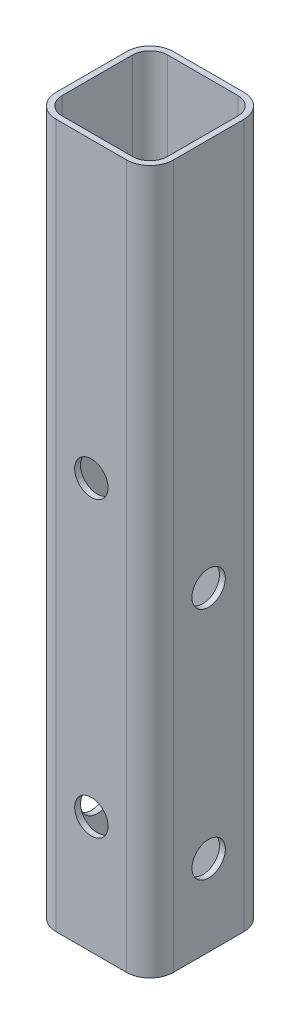
ISO-10303-21;
HEADER;
FILE_DESCRIPTION(('STEP AP214'),'2;1');
FILE_NAME('part.step','',(''),(''),'','','');
FILE_SCHEMA(('AUTOMOTIVE_DESIGN { 1 0 10303 214 1 1 1 1 }'));
ENDSEC;
DATA;
#1=APPLICATION_CONTEXT('core data for automotive mechanical design processes');
#2=APPLICATION_PROTOCOL_DEFINITION('international standard','automotive_design',2000,#1);
#3=PRODUCT_CONTEXT('',#1,'mechanical');
#4=PRODUCT('Part','Part','',(#3));
#5=PRODUCT_RELATED_PRODUCT_CATEGORY('part','',(#4));
#6=PRODUCT_DEFINITION_FORMATION('','',#4);
#7=PRODUCT_DEFINITION_CONTEXT('part definition',#1,'design');
#8=PRODUCT_DEFINITION('design','',#6,#7);
#9=PRODUCT_DEFINITION_SHAPE('','',#8);
#10=(LENGTH_UNIT() NAMED_UNIT(*) SI_UNIT(.MILLI.,.METRE.));
#11=(NAMED_UNIT(*) PLANE_ANGLE_UNIT() SI_UNIT($,.RADIAN.));
#12=(NAMED_UNIT(*) SI_UNIT($,.STERADIAN.) SOLID_ANGLE_UNIT());
#13=UNCERTAINTY_MEASURE_WITH_UNIT(LENGTH_MEASURE(1.E-05),#10,'distance_accuracy_value','');
#14=(GEOMETRIC_REPRESENTATION_CONTEXT(3) GLOBAL_UNCERTAINTY_ASSIGNED_CONTEXT((#13)) GLOBAL_UNIT_ASSIGNED_CONTEXT((#10,
#11,#12)) REPRESENTATION_CONTEXT('',''));
#15=CARTESIAN_POINT('',(0.,0.,0.));
#16=DIRECTION('',(0.,0.,1.));
#17=DIRECTION('',(1.,0.,0.));
#18=AXIS2_PLACEMENT_3D('',#15,#16,#17);
#19=CARTESIAN_POINT('',(-7.62000000000001,152.4,7.62000000000001));
#20=DIRECTION('',(0.,1.,0.));
#21=DIRECTION('',(0.,0.,1.));
#22=AXIS2_PLACEMENT_3D('',#19,#20,#21);
#23=PLANE('',#22);
#24=CARTESIAN_POINT('',(-7.62000000000001,152.4,7.62000000000001));
#25=DIRECTION('',(0.,1.,0.));
#26=DIRECTION('',(0.,0.,1.));
#27=AXIS2_PLACEMENT_3D('',#24,#25,#26);
#28=CIRCLE('',#27,5.08);
#29=CARTESIAN_POINT('',(-12.7,152.4,7.62000000000001));
#30=VERTEX_POINT('',#29);
#31=CARTESIAN_POINT('',(-7.62000000000001,152.4,12.7));
#32=VERTEX_POINT('',#31);
#33=EDGE_CURVE('E220',#30,#32,#28,.T.);
#34=ORIENTED_EDGE('',*,*,#33,.T.);
#35=DIRECTION('',(1.,0.,0.));
#36=VECTOR('',#35,1.);
#37=CARTESIAN_POINT('',(-7.62000000000001,152.4,12.7));
#38=LINE('',#37,#36);
#39=CARTESIAN_POINT('',(7.62,152.4,12.7));
#40=VERTEX_POINT('',#39);
#41=EDGE_CURVE('E223',#32,#40,#38,.T.);
#42=ORIENTED_EDGE('',*,*,#41,.T.);
#43=CARTESIAN_POINT('',(7.62,152.4,7.62000000000001));
#44=DIRECTION('',(0.,1.,0.));
#45=DIRECTION('',(0.,0.,-1.));
#46=AXIS2_PLACEMENT_3D('',#43,#44,#45);
#47=CIRCLE('',#46,5.08);
#48=CARTESIAN_POINT('',(12.7,152.4,7.62000000000001));
#49=VERTEX_POINT('',#48);
#50=EDGE_CURVE('E226',#40,#49,#47,.T.);
#51=ORIENTED_EDGE('',*,*,#50,.T.);
#52=DIRECTION('',(0.,0.,-1.));
#53=VECTOR('',#52,1.);
#54=CARTESIAN_POINT('',(12.7,152.4,-7.62000000000001));
#55=LINE('',#54,#53);
#56=CARTESIAN_POINT('',(12.7,152.4,-7.62000000000001));
#57=VERTEX_POINT('',#56);
#58=EDGE_CURVE('E228',#49,#57,#55,.T.);
#59=ORIENTED_EDGE('',*,*,#58,.T.);
#60=CARTESIAN_POINT('',(7.62,152.4,-7.62000000000001));
#61=DIRECTION('',(0.,1.,0.));
#62=DIRECTION('',(0.,0.,-1.));
#63=AXIS2_PLACEMENT_3D('',#60,#61,#62);
#64=CIRCLE('',#63,5.08);
#65=CARTESIAN_POINT('',(7.62000000000001,152.4,-12.7));
#66=VERTEX_POINT('',#65);
#67=EDGE_CURVE('E230',#57,#66,#64,.T.);
#68=ORIENTED_EDGE('',*,*,#67,.T.);
#69=DIRECTION('',(-1.,0.,0.));
#70=VECTOR('',#69,1.);
#71=CARTESIAN_POINT('',(-7.62000000000001,152.4,-12.7));
#72=LINE('',#71,#70);
#73=CARTESIAN_POINT('',(-7.62,152.4,-12.7));
#74=VERTEX_POINT('',#73);
#75=EDGE_CURVE('E232',#66,#74,#72,.T.);
#76=ORIENTED_EDGE('',*,*,#75,.T.);
#77=CARTESIAN_POINT('',(-7.62,152.4,-7.62000000000001));
#78=DIRECTION('',(0.,1.,0.));
#79=DIRECTION('',(0.,0.,-1.));
#80=AXIS2_PLACEMENT_3D('',#77,#78,#79);
#81=CIRCLE('',#80,5.08);
#82=CARTESIAN_POINT('',(-12.7,152.4,-7.62000000000001));
#83=VERTEX_POINT('',#82);
#84=EDGE_CURVE('E234',#74,#83,#81,.T.);
#85=ORIENTED_EDGE('',*,*,#84,.T.);
#86=DIRECTION('',(0.,0.,1.));
#87=VECTOR('',#86,1.);
#88=CARTESIAN_POINT('',(-12.7,152.4,-7.62000000000001));
#89=LINE('',#88,#87);
#90=EDGE_CURVE('E236',#83,#30,#89,.T.);
#91=ORIENTED_EDGE('',*,*,#90,.T.);
#92=EDGE_LOOP('',(#34,#42,#51,#59,#68,#76,#85,#91));
#93=FACE_BOUND('',#92,.T.);
#94=DIRECTION('',(0.,0.,1.));
#95=VECTOR('',#94,1.);
#96=CARTESIAN_POINT('',(-11.43,152.4,-7.62000000000001));
#97=LINE('',#96,#95);
#98=CARTESIAN_POINT('',(-11.43,152.4,-7.62000000000001));
#99=VERTEX_POINT('',#98);
#100=CARTESIAN_POINT('',(-11.43,152.4,7.62000000000001));
#101=VERTEX_POINT('',#100);
#102=EDGE_CURVE('E161',#99,#101,#97,.T.);
#103=ORIENTED_EDGE('',*,*,#102,.F.);
#104=CARTESIAN_POINT('',(-7.62,152.4,-7.62000000000001));
#105=DIRECTION('',(0.,1.,0.));
#106=DIRECTION('',(0.,0.,-1.));
#107=AXIS2_PLACEMENT_3D('',#104,#105,#106);
#108=CIRCLE('',#107,3.81);
#109=CARTESIAN_POINT('',(-7.62000000000001,152.4,-11.43));
#110=VERTEX_POINT('',#109);
#111=EDGE_CURVE('E153',#110,#99,#108,.T.);
#112=ORIENTED_EDGE('',*,*,#111,.F.);
#113=DIRECTION('',(-1.,0.,0.));
#114=VECTOR('',#113,1.);
#115=CARTESIAN_POINT('',(-7.62000000000001,152.4,-11.43));
#116=LINE('',#115,#114);
#117=CARTESIAN_POINT('',(7.62,152.4,-11.43));
#118=VERTEX_POINT('',#117);
#119=EDGE_CURVE('E187',#118,#110,#116,.T.);
#120=ORIENTED_EDGE('',*,*,#119,.F.);
#121=CARTESIAN_POINT('',(7.62,152.4,-7.62000000000001));
#122=DIRECTION('',(0.,1.,0.));
#123=DIRECTION('',(0.,0.,-1.));
#124=AXIS2_PLACEMENT_3D('',#121,#122,#123);
#125=CIRCLE('',#124,3.81);
#126=CARTESIAN_POINT('',(11.43,152.4,-7.62000000000001));
#127=VERTEX_POINT('',#126);
#128=EDGE_CURVE('E185',#127,#118,#125,.T.);
#129=ORIENTED_EDGE('',*,*,#128,.F.);
#130=DIRECTION('',(0.,0.,-1.));
#131=VECTOR('',#130,1.);
#132=CARTESIAN_POINT('',(11.43,152.4,-7.62000000000001));
#133=LINE('',#132,#131);
#134=CARTESIAN_POINT('',(11.43,152.4,7.62000000000001));
#135=VERTEX_POINT('',#134);
#136=EDGE_CURVE('E183',#135,#127,#133,.T.);
#137=ORIENTED_EDGE('',*,*,#136,.F.);
#138=CARTESIAN_POINT('',(7.62,152.4,7.62000000000001));
#139=DIRECTION('',(0.,1.,0.));
#140=DIRECTION('',(0.,0.,-1.));
#141=AXIS2_PLACEMENT_3D('',#138,#139,#140);
#142=CIRCLE('',#141,3.81);
#143=CARTESIAN_POINT('',(7.62,152.4,11.43));
#144=VERTEX_POINT('',#143);
#145=EDGE_CURVE('E181',#144,#135,#142,.T.);
#146=ORIENTED_EDGE('',*,*,#145,.F.);
#147=DIRECTION('',(1.,0.,0.));
#148=VECTOR('',#147,1.);
#149=CARTESIAN_POINT('',(-7.62000000000001,152.4,11.43));
#150=LINE('',#149,#148);
#151=CARTESIAN_POINT('',(-7.62000000000001,152.4,11.43));
#152=VERTEX_POINT('',#151);
#153=EDGE_CURVE('E176',#152,#144,#150,.T.);
#154=ORIENTED_EDGE('',*,*,#153,.F.);
#155=CARTESIAN_POINT('',(-7.62000000000001,152.4,7.62000000000001));
#156=DIRECTION('',(0.,1.,0.));
#157=DIRECTION('',(0.,0.,1.));
#158=AXIS2_PLACEMENT_3D('',#155,#156,#157);
#159=CIRCLE('',#158,3.81);
#160=EDGE_CURVE('E174',#101,#152,#159,.T.);
#161=ORIENTED_EDGE('',*,*,#160,.F.);
#162=EDGE_LOOP('',(#103,#112,#120,#129,#137,#146,#154,#161));
#163=FACE_BOUND('',#162,.T.);
#164=ADVANCED_FACE('F38',(#93,#163),#23,.T.);
#165=CARTESIAN_POINT('',(-7.62000000000001,0.,7.62000000000001));
#166=DIRECTION('',(0.,1.,0.));
#167=DIRECTION('',(0.,0.,1.));
#168=AXIS2_PLACEMENT_3D('',#165,#166,#167);
#169=PLANE('',#168);
#170=CARTESIAN_POINT('',(-7.62000000000001,0.,7.62000000000001));
#171=DIRECTION('',(0.,1.,0.));
#172=DIRECTION('',(0.,0.,1.));
#173=AXIS2_PLACEMENT_3D('',#170,#171,#172);
#174=CIRCLE('',#173,5.08);
#175=CARTESIAN_POINT('',(-12.7,0.,7.62000000000001));
#176=VERTEX_POINT('',#175);
#177=CARTESIAN_POINT('',(-7.62000000000001,0.,12.7));
#178=VERTEX_POINT('',#177);
#179=EDGE_CURVE('E169',#176,#178,#174,.T.);
#180=ORIENTED_EDGE('',*,*,#179,.F.);
#181=DIRECTION('',(0.,0.,1.));
#182=VECTOR('',#181,1.);
#183=CARTESIAN_POINT('',(-12.7,0.,-7.62000000000001));
#184=LINE('',#183,#182);
#185=CARTESIAN_POINT('',(-12.7,0.,-7.62000000000001));
#186=VERTEX_POINT('',#185);
#187=EDGE_CURVE('E224',#186,#176,#184,.T.);
#188=ORIENTED_EDGE('',*,*,#187,.F.);
#189=CARTESIAN_POINT('',(-7.62,0.,-7.62000000000001));
#190=DIRECTION('',(0.,1.,0.));
#191=DIRECTION('',(0.,0.,-1.));
#192=AXIS2_PLACEMENT_3D('',#189,#190,#191);
#193=CIRCLE('',#192,5.08);
#194=CARTESIAN_POINT('',(-7.62,0.,-12.7));
#195=VERTEX_POINT('',#194);
#196=EDGE_CURVE('E251',#195,#186,#193,.T.);
#197=ORIENTED_EDGE('',*,*,#196,.F.);
#198=DIRECTION('',(-1.,0.,0.));
#199=VECTOR('',#198,1.);
#200=CARTESIAN_POINT('',(-7.62000000000001,0.,-12.7));
#201=LINE('',#200,#199);
#202=CARTESIAN_POINT('',(7.62000000000001,0.,-12.7));
#203=VERTEX_POINT('',#202);
#204=EDGE_CURVE('E249',#203,#195,#201,.T.);
#205=ORIENTED_EDGE('',*,*,#204,.F.);
#206=CARTESIAN_POINT('',(7.62,0.,-7.62000000000001));
#207=DIRECTION('',(0.,1.,0.));
#208=DIRECTION('',(0.,0.,-1.));
#209=AXIS2_PLACEMENT_3D('',#206,#207,#208);
#210=CIRCLE('',#209,5.08);
#211=CARTESIAN_POINT('',(12.7,0.,-7.62000000000001));
#212=VERTEX_POINT('',#211);
#213=EDGE_CURVE('E247',#212,#203,#210,.T.);
#214=ORIENTED_EDGE('',*,*,#213,.F.);
#215=DIRECTION('',(0.,0.,-1.));
#216=VECTOR('',#215,1.);
#217=CARTESIAN_POINT('',(12.7,0.,-7.62000000000001));
#218=LINE('',#217,#216);
#219=CARTESIAN_POINT('',(12.7,0.,7.62000000000001));
#220=VERTEX_POINT('',#219);
#221=EDGE_CURVE('E245',#220,#212,#218,.T.);
#222=ORIENTED_EDGE('',*,*,#221,.F.);
#223=CARTESIAN_POINT('',(7.62,0.,7.62000000000001));
#224=DIRECTION('',(0.,1.,0.));
#225=DIRECTION('',(0.,0.,-1.));
#226=AXIS2_PLACEMENT_3D('',#223,#224,#225);
#227=CIRCLE('',#226,5.08);
#228=CARTESIAN_POINT('',(7.62,0.,12.7));
#229=VERTEX_POINT('',#228);
#230=EDGE_CURVE('E243',#229,#220,#227,.T.);
#231=ORIENTED_EDGE('',*,*,#230,.F.);
#232=DIRECTION('',(1.,0.,0.));
#233=VECTOR('',#232,1.);
#234=CARTESIAN_POINT('',(-7.62000000000001,0.,12.7));
#235=LINE('',#234,#233);
#236=EDGE_CURVE('E241',#178,#229,#235,.T.);
#237=ORIENTED_EDGE('',*,*,#236,.F.);
#238=EDGE_LOOP('',(#180,#188,#197,#205,#214,#222,#231,#237));
#239=FACE_BOUND('',#238,.T.);
#240=CARTESIAN_POINT('',(-7.62,0.,-7.62000000000001));
#241=DIRECTION('',(0.,1.,0.));
#242=DIRECTION('',(0.,0.,-1.));
#243=AXIS2_PLACEMENT_3D('',#240,#241,#242);
#244=CIRCLE('',#243,3.81);
#245=CARTESIAN_POINT('',(-7.62000000000001,0.,-11.43));
#246=VERTEX_POINT('',#245);
#247=CARTESIAN_POINT('',(-11.43,0.,-7.62000000000001));
#248=VERTEX_POINT('',#247);
#249=EDGE_CURVE('E63',#246,#248,#244,.T.);
#250=ORIENTED_EDGE('',*,*,#249,.T.);
#251=DIRECTION('',(0.,0.,1.));
#252=VECTOR('',#251,1.);
#253=CARTESIAN_POINT('',(-11.43,0.,-7.62000000000001));
#254=LINE('',#253,#252);
#255=CARTESIAN_POINT('',(-11.43,0.,7.62000000000001));
#256=VERTEX_POINT('',#255);
#257=EDGE_CURVE('E168',#248,#256,#254,.T.);
#258=ORIENTED_EDGE('',*,*,#257,.T.);
#259=CARTESIAN_POINT('',(-7.62000000000001,0.,7.62000000000001));
#260=DIRECTION('',(0.,1.,0.));
#261=DIRECTION('',(0.,0.,1.));
#262=AXIS2_PLACEMENT_3D('',#259,#260,#261);
#263=CIRCLE('',#262,3.81);
#264=CARTESIAN_POINT('',(-7.62000000000001,0.,11.43));
#265=VERTEX_POINT('',#264);
#266=EDGE_CURVE('E192',#256,#265,#263,.T.);
#267=ORIENTED_EDGE('',*,*,#266,.T.);
#268=DIRECTION('',(1.,0.,0.));
#269=VECTOR('',#268,1.);
#270=CARTESIAN_POINT('',(-7.62000000000001,0.,11.43));
#271=LINE('',#270,#269);
#272=CARTESIAN_POINT('',(7.62,0.,11.43));
#273=VERTEX_POINT('',#272);
#274=EDGE_CURVE('E195',#265,#273,#271,.T.);
#275=ORIENTED_EDGE('',*,*,#274,.T.);
#276=CARTESIAN_POINT('',(7.62,0.,7.62000000000001));
#277=DIRECTION('',(0.,1.,0.));
#278=DIRECTION('',(0.,0.,-1.));
#279=AXIS2_PLACEMENT_3D('',#276,#277,#278);
#280=CIRCLE('',#279,3.81);
#281=CARTESIAN_POINT('',(11.43,0.,7.62000000000001));
#282=VERTEX_POINT('',#281);
#283=EDGE_CURVE('E198',#273,#282,#280,.T.);
#284=ORIENTED_EDGE('',*,*,#283,.T.);
#285=DIRECTION('',(0.,0.,-1.));
#286=VECTOR('',#285,1.);
#287=CARTESIAN_POINT('',(11.43,0.,-7.62000000000001));
#288=LINE('',#287,#286);
#289=CARTESIAN_POINT('',(11.43,0.,-7.62000000000001));
#290=VERTEX_POINT('',#289);
#291=EDGE_CURVE('E201',#282,#290,#288,.T.);
#292=ORIENTED_EDGE('',*,*,#291,.T.);
#293=CARTESIAN_POINT('',(7.62,0.,-7.62000000000001));
#294=DIRECTION('',(0.,1.,0.));
#295=DIRECTION('',(0.,0.,-1.));
#296=AXIS2_PLACEMENT_3D('',#293,#294,#295);
#297=CIRCLE('',#296,3.81);
#298=CARTESIAN_POINT('',(7.62000000000001,0.,-11.43));
#299=VERTEX_POINT('',#298);
#300=EDGE_CURVE('E204',#290,#299,#297,.T.);
#301=ORIENTED_EDGE('',*,*,#300,.T.);
#302=DIRECTION('',(-1.,0.,0.));
#303=VECTOR('',#302,1.);
#304=CARTESIAN_POINT('',(-7.62000000000001,0.,-11.43));
#305=LINE('',#304,#303);
#306=EDGE_CURVE('E162',#299,#246,#305,.T.);
#307=ORIENTED_EDGE('',*,*,#306,.T.);
#308=EDGE_LOOP('',(#250,#258,#267,#275,#284,#292,#301,#307));
#309=FACE_BOUND('',#308,.T.);
#310=ADVANCED_FACE('F337',(#239,#309),#169,.F.);
#311=CARTESIAN_POINT('',(-7.62000000000001,152.4,7.62000000000001));
#312=DIRECTION('',(0.,-1.,0.));
#313=DIRECTION('',(0.,0.,-1.));
#314=AXIS2_PLACEMENT_3D('',#311,#312,#313);
#315=CYLINDRICAL_SURFACE('',#314,5.08);
#316=ORIENTED_EDGE('',*,*,#179,.T.);
#317=DIRECTION('',(0.,-1.,0.));
#318=VECTOR('',#317,1.);
#319=CARTESIAN_POINT('',(-7.62000000000001,152.4,12.7));
#320=LINE('',#319,#318);
#321=EDGE_CURVE('E11',#32,#178,#320,.T.);
#322=ORIENTED_EDGE('',*,*,#321,.F.);
#323=ORIENTED_EDGE('',*,*,#33,.F.);
#324=DIRECTION('',(0.,-1.,0.));
#325=VECTOR('',#324,1.);
#326=CARTESIAN_POINT('',(-12.7,152.4,7.62000000000001));
#327=LINE('',#326,#325);
#328=EDGE_CURVE('E238',#30,#176,#327,.T.);
#329=ORIENTED_EDGE('',*,*,#328,.T.);
#330=EDGE_LOOP('',(#316,#322,#323,#329));
#331=FACE_BOUND('',#330,.T.);
#332=ADVANCED_FACE('F40',(#331),#315,.T.);
#333=CARTESIAN_POINT('',(-7.62000000000001,152.4,12.7));
#334=DIRECTION('',(0.,0.,-1.));
#335=DIRECTION('',(-1.,0.,0.));
#336=AXIS2_PLACEMENT_3D('',#333,#334,#335);
#337=PLANE('',#336);
#338=CARTESIAN_POINT('',(0.,88.9,12.7));
#339=DIRECTION('',(0.,0.,1.));
#340=DIRECTION('',(1.,0.,0.));
#341=AXIS2_PLACEMENT_3D('',#338,#339,#340);
#342=CIRCLE('',#341,3.6195);
#343=CARTESIAN_POINT('',(3.6195,88.9,12.7));
#344=VERTEX_POINT('',#343);
#345=EDGE_CURVE('E308',#344,#344,#342,.T.);
#346=ORIENTED_EDGE('',*,*,#345,.F.);
#347=EDGE_LOOP('',(#346));
#348=FACE_BOUND('',#347,.T.);
#349=CARTESIAN_POINT('',(0.,25.4,12.7));
#350=DIRECTION('',(0.,0.,1.));
#351=DIRECTION('',(1.,0.,0.));
#352=AXIS2_PLACEMENT_3D('',#349,#350,#351);
#353=CIRCLE('',#352,3.6195);
#354=CARTESIAN_POINT('',(3.6195,25.4,12.7));
#355=VERTEX_POINT('',#354);
#356=EDGE_CURVE('E311',#355,#355,#353,.T.);
#357=ORIENTED_EDGE('',*,*,#356,.F.);
#358=EDGE_LOOP('',(#357));
#359=FACE_BOUND('',#358,.T.);
#360=ORIENTED_EDGE('',*,*,#236,.T.);
#361=DIRECTION('',(0.,-1.,0.));
#362=VECTOR('',#361,1.);
#363=CARTESIAN_POINT('',(7.62,152.4,12.7));
#364=LINE('',#363,#362);
#365=EDGE_CURVE('E47',#40,#229,#364,.T.);
#366=ORIENTED_EDGE('',*,*,#365,.F.);
#367=ORIENTED_EDGE('',*,*,#41,.F.);
#368=ORIENTED_EDGE('',*,*,#321,.T.);
#369=EDGE_LOOP('',(#360,#366,#367,#368));
#370=FACE_BOUND('',#369,.T.);
#371=ADVANCED_FACE('F379',(#348,#359,#370),#337,.F.);
#372=CARTESIAN_POINT('',(7.62,152.4,7.62000000000001));
#373=DIRECTION('',(0.,-1.,0.));
#374=DIRECTION('',(0.,0.,-1.));
#375=AXIS2_PLACEMENT_3D('',#372,#373,#374);
#376=CYLINDRICAL_SURFACE('',#375,5.08);
#377=ORIENTED_EDGE('',*,*,#230,.T.);
#378=DIRECTION('',(0.,-1.,0.));
#379=VECTOR('',#378,1.);
#380=CARTESIAN_POINT('',(12.7,152.4,7.62000000000001));
#381=LINE('',#380,#379);
#382=EDGE_CURVE('E268',#49,#220,#381,.T.);
#383=ORIENTED_EDGE('',*,*,#382,.F.);
#384=ORIENTED_EDGE('',*,*,#50,.F.);
#385=ORIENTED_EDGE('',*,*,#365,.T.);
#386=EDGE_LOOP('',(#377,#383,#384,#385));
#387=FACE_BOUND('',#386,.T.);
#388=ADVANCED_FACE('F377',(#387),#376,.T.);
#389=CARTESIAN_POINT('',(12.7,152.4,-7.62000000000001));
#390=DIRECTION('',(-1.,0.,0.));
#391=DIRECTION('',(0.,0.,1.));
#392=AXIS2_PLACEMENT_3D('',#389,#390,#391);
#393=PLANE('',#392);
#394=CARTESIAN_POINT('',(12.7,17.526,0.));
#395=DIRECTION('',(-1.,0.,0.));
#396=DIRECTION('',(0.,0.,1.));
#397=AXIS2_PLACEMENT_3D('',#394,#395,#396);
#398=CIRCLE('',#397,3.6195);
#399=CARTESIAN_POINT('',(12.7,17.526,3.6195));
#400=VERTEX_POINT('',#399);
#401=EDGE_CURVE('E283',#400,#400,#398,.T.);
#402=ORIENTED_EDGE('',*,*,#401,.T.);
#403=EDGE_LOOP('',(#402));
#404=FACE_BOUND('',#403,.T.);
#405=CARTESIAN_POINT('',(12.7,68.326,0.));
#406=DIRECTION('',(-1.,0.,0.));
#407=DIRECTION('',(0.,0.,1.));
#408=AXIS2_PLACEMENT_3D('',#405,#406,#407);
#409=CIRCLE('',#408,3.6195);
#410=CARTESIAN_POINT('',(12.7,68.326,3.6195));
#411=VERTEX_POINT('',#410);
#412=EDGE_CURVE('E299',#411,#411,#409,.T.);
#413=ORIENTED_EDGE('',*,*,#412,.T.);
#414=EDGE_LOOP('',(#413));
#415=FACE_BOUND('',#414,.T.);
#416=ORIENTED_EDGE('',*,*,#221,.T.);
#417=DIRECTION('',(0.,-1.,0.));
#418=VECTOR('',#417,1.);
#419=CARTESIAN_POINT('',(12.7,152.4,-7.62000000000001));
#420=LINE('',#419,#418);
#421=EDGE_CURVE('E265',#57,#212,#420,.T.);
#422=ORIENTED_EDGE('',*,*,#421,.F.);
#423=ORIENTED_EDGE('',*,*,#58,.F.);
#424=ORIENTED_EDGE('',*,*,#382,.T.);
#425=EDGE_LOOP('',(#416,#422,#423,#424));
#426=FACE_BOUND('',#425,.T.);
#427=ADVANCED_FACE('F373',(#404,#415,#426),#393,.F.);
#428=CARTESIAN_POINT('',(7.62,152.4,-7.62000000000001));
#429=DIRECTION('',(0.,-1.,0.));
#430=DIRECTION('',(0.,0.,-1.));
#431=AXIS2_PLACEMENT_3D('',#428,#429,#430);
#432=CYLINDRICAL_SURFACE('',#431,5.08);
#433=ORIENTED_EDGE('',*,*,#213,.T.);
#434=DIRECTION('',(0.,-1.,0.));
#435=VECTOR('',#434,1.);
#436=CARTESIAN_POINT('',(7.62000000000001,152.4,-12.7));
#437=LINE('',#436,#435);
#438=EDGE_CURVE('E262',#66,#203,#437,.T.);
#439=ORIENTED_EDGE('',*,*,#438,.F.);
#440=ORIENTED_EDGE('',*,*,#67,.F.);
#441=ORIENTED_EDGE('',*,*,#421,.T.);
#442=EDGE_LOOP('',(#433,#439,#440,#441));
#443=FACE_BOUND('',#442,.T.);
#444=ADVANCED_FACE('F369',(#443),#432,.T.);
#445=CARTESIAN_POINT('',(-7.62000000000001,152.4,-12.7));
#446=DIRECTION('',(0.,0.,1.));
#447=DIRECTION('',(1.,0.,0.));
#448=AXIS2_PLACEMENT_3D('',#445,#446,#447);
#449=PLANE('',#448);
#450=CARTESIAN_POINT('',(0.,88.9,-12.7));
#451=DIRECTION('',(0.,0.,1.));
#452=DIRECTION('',(1.,0.,0.));
#453=AXIS2_PLACEMENT_3D('',#450,#451,#452);
#454=CIRCLE('',#453,3.6195);
#455=CARTESIAN_POINT('',(3.6195,88.9,-12.7));
#456=VERTEX_POINT('',#455);
#457=EDGE_CURVE('E277',#456,#456,#454,.T.);
#458=ORIENTED_EDGE('',*,*,#457,.T.);
#459=EDGE_LOOP('',(#458));
#460=FACE_BOUND('',#459,.T.);
#461=CARTESIAN_POINT('',(0.,25.4,-12.7));
#462=DIRECTION('',(0.,0.,1.));
#463=DIRECTION('',(1.,0.,0.));
#464=AXIS2_PLACEMENT_3D('',#461,#462,#463);
#465=CIRCLE('',#464,3.6195);
#466=CARTESIAN_POINT('',(3.6195,25.4,-12.7));
#467=VERTEX_POINT('',#466);
#468=EDGE_CURVE('E305',#467,#467,#465,.T.);
#469=ORIENTED_EDGE('',*,*,#468,.T.);
#470=EDGE_LOOP('',(#469));
#471=FACE_BOUND('',#470,.T.);
#472=ORIENTED_EDGE('',*,*,#204,.T.);
#473=DIRECTION('',(0.,-1.,0.));
#474=VECTOR('',#473,1.);
#475=CARTESIAN_POINT('',(-7.62,152.4,-12.7));
#476=LINE('',#475,#474);
#477=EDGE_CURVE('E259',#74,#195,#476,.T.);
#478=ORIENTED_EDGE('',*,*,#477,.F.);
#479=ORIENTED_EDGE('',*,*,#75,.F.);
#480=ORIENTED_EDGE('',*,*,#438,.T.);
#481=EDGE_LOOP('',(#472,#478,#479,#480));
#482=FACE_BOUND('',#481,.T.);
#483=ADVANCED_FACE('F365',(#460,#471,#482),#449,.F.);
#484=CARTESIAN_POINT('',(-7.62,152.4,-7.62000000000001));
#485=DIRECTION('',(0.,-1.,0.));
#486=DIRECTION('',(0.,0.,-1.));
#487=AXIS2_PLACEMENT_3D('',#484,#485,#486);
#488=CYLINDRICAL_SURFACE('',#487,5.08);
#489=ORIENTED_EDGE('',*,*,#196,.T.);
#490=DIRECTION('',(0.,-1.,0.));
#491=VECTOR('',#490,1.);
#492=CARTESIAN_POINT('',(-12.7,152.4,-7.62000000000001));
#493=LINE('',#492,#491);
#494=EDGE_CURVE('E256',#83,#186,#493,.T.);
#495=ORIENTED_EDGE('',*,*,#494,.F.);
#496=ORIENTED_EDGE('',*,*,#84,.F.);
#497=ORIENTED_EDGE('',*,*,#477,.T.);
#498=EDGE_LOOP('',(#489,#495,#496,#497));
#499=FACE_BOUND('',#498,.T.);
#500=ADVANCED_FACE('F361',(#499),#488,.T.);
#501=CARTESIAN_POINT('',(-12.7,152.4,-7.62000000000001));
#502=DIRECTION('',(1.,0.,0.));
#503=DIRECTION('',(0.,0.,-1.));
#504=AXIS2_PLACEMENT_3D('',#501,#502,#503);
#505=PLANE('',#504);
#506=CARTESIAN_POINT('',(-12.7,17.526,0.));
#507=DIRECTION('',(-1.,0.,0.));
#508=DIRECTION('',(0.,0.,1.));
#509=AXIS2_PLACEMENT_3D('',#506,#507,#508);
#510=CIRCLE('',#509,3.6195);
#511=CARTESIAN_POINT('',(-12.7,17.526,3.6195));
#512=VERTEX_POINT('',#511);
#513=EDGE_CURVE('E289',#512,#512,#510,.T.);
#514=ORIENTED_EDGE('',*,*,#513,.F.);
#515=EDGE_LOOP('',(#514));
#516=FACE_BOUND('',#515,.T.);
#517=CARTESIAN_POINT('',(-12.7,68.326,0.));
#518=DIRECTION('',(-1.,0.,0.));
#519=DIRECTION('',(0.,0.,1.));
#520=AXIS2_PLACEMENT_3D('',#517,#518,#519);
#521=CIRCLE('',#520,3.6195);
#522=CARTESIAN_POINT('',(-12.7,68.326,3.6195));
#523=VERTEX_POINT('',#522);
#524=EDGE_CURVE('E294',#523,#523,#521,.T.);
#525=ORIENTED_EDGE('',*,*,#524,.F.);
#526=EDGE_LOOP('',(#525));
#527=FACE_BOUND('',#526,.T.);
#528=ORIENTED_EDGE('',*,*,#187,.T.);
#529=ORIENTED_EDGE('',*,*,#328,.F.);
#530=ORIENTED_EDGE('',*,*,#90,.F.);
#531=ORIENTED_EDGE('',*,*,#494,.T.);
#532=EDGE_LOOP('',(#528,#529,#530,#531));
#533=FACE_BOUND('',#532,.T.);
#534=ADVANCED_FACE('F358',(#516,#527,#533),#505,.F.);
#535=CARTESIAN_POINT('',(-7.62,152.4,-7.62000000000001));
#536=DIRECTION('',(0.,-1.,0.));
#537=DIRECTION('',(0.,0.,-1.));
#538=AXIS2_PLACEMENT_3D('',#535,#536,#537);
#539=CYLINDRICAL_SURFACE('',#538,3.81);
#540=ORIENTED_EDGE('',*,*,#249,.F.);
#541=DIRECTION('',(0.,-1.,0.));
#542=VECTOR('',#541,1.);
#543=CARTESIAN_POINT('',(-7.62000000000001,152.4,-11.43));
#544=LINE('',#543,#542);
#545=EDGE_CURVE('E157',#110,#246,#544,.T.);
#546=ORIENTED_EDGE('',*,*,#545,.F.);
#547=ORIENTED_EDGE('',*,*,#111,.T.);
#548=DIRECTION('',(0.,-1.,0.));
#549=VECTOR('',#548,1.);
#550=CARTESIAN_POINT('',(-11.43,152.4,-7.62000000000001));
#551=LINE('',#550,#549);
#552=EDGE_CURVE('E156',#99,#248,#551,.T.);
#553=ORIENTED_EDGE('',*,*,#552,.T.);
#554=EDGE_LOOP('',(#540,#546,#547,#553));
#555=FACE_BOUND('',#554,.T.);
#556=ADVANCED_FACE('F155',(#555),#539,.F.);
#557=CARTESIAN_POINT('',(-11.43,152.4,-7.62000000000001));
#558=DIRECTION('',(1.,0.,0.));
#559=DIRECTION('',(0.,0.,-1.));
#560=AXIS2_PLACEMENT_3D('',#557,#558,#559);
#561=PLANE('',#560);
#562=CARTESIAN_POINT('',(-11.43,17.526,0.));
#563=DIRECTION('',(1.,0.,0.));
#564=DIRECTION('',(0.,0.,-1.));
#565=AXIS2_PLACEMENT_3D('',#562,#563,#564);
#566=CIRCLE('',#565,3.6195);
#567=CARTESIAN_POINT('',(-11.43,17.526,-3.6195));
#568=VERTEX_POINT('',#567);
#569=EDGE_CURVE('E302',#568,#568,#566,.T.);
#570=ORIENTED_EDGE('',*,*,#569,.F.);
#571=EDGE_LOOP('',(#570));
#572=FACE_BOUND('',#571,.T.);
#573=CARTESIAN_POINT('',(-11.43,68.326,0.));
#574=DIRECTION('',(1.,0.,0.));
#575=DIRECTION('',(0.,0.,-1.));
#576=AXIS2_PLACEMENT_3D('',#573,#574,#575);
#577=CIRCLE('',#576,3.6195);
#578=CARTESIAN_POINT('',(-11.43,68.326,-3.6195));
#579=VERTEX_POINT('',#578);
#580=EDGE_CURVE('E282',#579,#579,#577,.T.);
#581=ORIENTED_EDGE('',*,*,#580,.F.);
#582=EDGE_LOOP('',(#581));
#583=FACE_BOUND('',#582,.T.);
#584=ORIENTED_EDGE('',*,*,#257,.F.);
#585=ORIENTED_EDGE('',*,*,#552,.F.);
#586=ORIENTED_EDGE('',*,*,#102,.T.);
#587=DIRECTION('',(0.,-1.,0.));
#588=VECTOR('',#587,1.);
#589=CARTESIAN_POINT('',(-11.43,152.4,7.62000000000001));
#590=LINE('',#589,#588);
#591=EDGE_CURVE('E170',#101,#256,#590,.T.);
#592=ORIENTED_EDGE('',*,*,#591,.T.);
#593=EDGE_LOOP('',(#584,#585,#586,#592));
#594=FACE_BOUND('',#593,.T.);
#595=ADVANCED_FACE('F165',(#572,#583,#594),#561,.T.);
#596=CARTESIAN_POINT('',(-7.62000000000001,152.4,7.62000000000001));
#597=DIRECTION('',(0.,-1.,0.));
#598=DIRECTION('',(0.,0.,-1.));
#599=AXIS2_PLACEMENT_3D('',#596,#597,#598);
#600=CYLINDRICAL_SURFACE('',#599,3.81);
#601=ORIENTED_EDGE('',*,*,#266,.F.);
#602=ORIENTED_EDGE('',*,*,#591,.F.);
#603=ORIENTED_EDGE('',*,*,#160,.T.);
#604=DIRECTION('',(0.,-1.,0.));
#605=VECTOR('',#604,1.);
#606=CARTESIAN_POINT('',(-7.62000000000001,152.4,11.43));
#607=LINE('',#606,#605);
#608=EDGE_CURVE('E217',#152,#265,#607,.T.);
#609=ORIENTED_EDGE('',*,*,#608,.T.);
#610=EDGE_LOOP('',(#601,#602,#603,#609));
#611=FACE_BOUND('',#610,.T.);
#612=ADVANCED_FACE('F327',(#611),#600,.F.);
#613=CARTESIAN_POINT('',(-7.62000000000001,152.4,11.43));
#614=DIRECTION('',(0.,0.,-1.));
#615=DIRECTION('',(-1.,0.,0.));
#616=AXIS2_PLACEMENT_3D('',#613,#614,#615);
#617=PLANE('',#616);
#618=CARTESIAN_POINT('',(0.,88.9,11.43));
#619=DIRECTION('',(0.,0.,-1.));
#620=DIRECTION('',(-1.,0.,0.));
#621=AXIS2_PLACEMENT_3D('',#618,#619,#620);
#622=CIRCLE('',#621,3.6195);
#623=CARTESIAN_POINT('',(-3.6195,88.9,11.43));
#624=VERTEX_POINT('',#623);
#625=EDGE_CURVE('E190',#624,#624,#622,.T.);
#626=ORIENTED_EDGE('',*,*,#625,.F.);
#627=EDGE_LOOP('',(#626));
#628=FACE_BOUND('',#627,.T.);
#629=CARTESIAN_POINT('',(0.,25.4,11.43));
#630=DIRECTION('',(0.,0.,-1.));
#631=DIRECTION('',(-1.,0.,0.));
#632=AXIS2_PLACEMENT_3D('',#629,#630,#631);
#633=CIRCLE('',#632,3.6195);
#634=CARTESIAN_POINT('',(-3.6195,25.4,11.43));
#635=VERTEX_POINT('',#634);
#636=EDGE_CURVE('E276',#635,#635,#633,.T.);
#637=ORIENTED_EDGE('',*,*,#636,.F.);
#638=EDGE_LOOP('',(#637));
#639=FACE_BOUND('',#638,.T.);
#640=ORIENTED_EDGE('',*,*,#274,.F.);
#641=ORIENTED_EDGE('',*,*,#608,.F.);
#642=ORIENTED_EDGE('',*,*,#153,.T.);
#643=DIRECTION('',(0.,-1.,0.));
#644=VECTOR('',#643,1.);
#645=CARTESIAN_POINT('',(7.62,152.4,11.43));
#646=LINE('',#645,#644);
#647=EDGE_CURVE('E215',#144,#273,#646,.T.);
#648=ORIENTED_EDGE('',*,*,#647,.T.);
#649=EDGE_LOOP('',(#640,#641,#642,#648));
#650=FACE_BOUND('',#649,.T.);
#651=ADVANCED_FACE('F323',(#628,#639,#650),#617,.T.);
#652=CARTESIAN_POINT('',(7.62,152.4,7.62000000000001));
#653=DIRECTION('',(0.,-1.,0.));
#654=DIRECTION('',(0.,0.,-1.));
#655=AXIS2_PLACEMENT_3D('',#652,#653,#654);
#656=CYLINDRICAL_SURFACE('',#655,3.81);
#657=ORIENTED_EDGE('',*,*,#283,.F.);
#658=ORIENTED_EDGE('',*,*,#647,.F.);
#659=ORIENTED_EDGE('',*,*,#145,.T.);
#660=DIRECTION('',(0.,-1.,0.));
#661=VECTOR('',#660,1.);
#662=CARTESIAN_POINT('',(11.43,152.4,7.62000000000001));
#663=LINE('',#662,#661);
#664=EDGE_CURVE('E213',#135,#282,#663,.T.);
#665=ORIENTED_EDGE('',*,*,#664,.T.);
#666=EDGE_LOOP('',(#657,#658,#659,#665));
#667=FACE_BOUND('',#666,.T.);
#668=ADVANCED_FACE('F326',(#667),#656,.F.);
#669=CARTESIAN_POINT('',(11.43,152.4,-7.62000000000001));
#670=DIRECTION('',(-1.,0.,0.));
#671=DIRECTION('',(0.,0.,1.));
#672=AXIS2_PLACEMENT_3D('',#669,#670,#671);
#673=PLANE('',#672);
#674=CARTESIAN_POINT('',(11.43,17.526,0.));
#675=DIRECTION('',(-1.,0.,0.));
#676=DIRECTION('',(0.,0.,1.));
#677=AXIS2_PLACEMENT_3D('',#674,#675,#676);
#678=CIRCLE('',#677,3.6195);
#679=CARTESIAN_POINT('',(11.43,17.526,3.6195));
#680=VERTEX_POINT('',#679);
#681=EDGE_CURVE('E42',#680,#680,#678,.T.);
#682=ORIENTED_EDGE('',*,*,#681,.F.);
#683=EDGE_LOOP('',(#682));
#684=FACE_BOUND('',#683,.T.);
#685=CARTESIAN_POINT('',(11.43,68.326,0.));
#686=DIRECTION('',(-1.,0.,0.));
#687=DIRECTION('',(0.,0.,1.));
#688=AXIS2_PLACEMENT_3D('',#685,#686,#687);
#689=CIRCLE('',#688,3.6195);
#690=CARTESIAN_POINT('',(11.43,68.326,3.6195));
#691=VERTEX_POINT('',#690);
#692=EDGE_CURVE('E280',#691,#691,#689,.T.);
#693=ORIENTED_EDGE('',*,*,#692,.F.);
#694=EDGE_LOOP('',(#693));
#695=FACE_BOUND('',#694,.T.);
#696=ORIENTED_EDGE('',*,*,#291,.F.);
#697=ORIENTED_EDGE('',*,*,#664,.F.);
#698=ORIENTED_EDGE('',*,*,#136,.T.);
#699=DIRECTION('',(0.,-1.,0.));
#700=VECTOR('',#699,1.);
#701=CARTESIAN_POINT('',(11.43,152.4,-7.62000000000001));
#702=LINE('',#701,#700);
#703=EDGE_CURVE('E211',#127,#290,#702,.T.);
#704=ORIENTED_EDGE('',*,*,#703,.T.);
#705=EDGE_LOOP('',(#696,#697,#698,#704));
#706=FACE_BOUND('',#705,.T.);
#707=ADVANCED_FACE('F455',(#684,#695,#706),#673,.T.);
#708=CARTESIAN_POINT('',(7.62,152.4,-7.62000000000001));
#709=DIRECTION('',(0.,-1.,0.));
#710=DIRECTION('',(0.,0.,-1.));
#711=AXIS2_PLACEMENT_3D('',#708,#709,#710);
#712=CYLINDRICAL_SURFACE('',#711,3.81);
#713=ORIENTED_EDGE('',*,*,#300,.F.);
#714=ORIENTED_EDGE('',*,*,#703,.F.);
#715=ORIENTED_EDGE('',*,*,#128,.T.);
#716=DIRECTION('',(0.,-1.,0.));
#717=VECTOR('',#716,1.);
#718=CARTESIAN_POINT('',(7.62000000000001,152.4,-11.43));
#719=LINE('',#718,#717);
#720=EDGE_CURVE('E55',#118,#299,#719,.T.);
#721=ORIENTED_EDGE('',*,*,#720,.T.);
#722=EDGE_LOOP('',(#713,#714,#715,#721));
#723=FACE_BOUND('',#722,.T.);
#724=ADVANCED_FACE('F439',(#723),#712,.F.);
#725=CARTESIAN_POINT('',(-7.62000000000001,152.4,-11.43));
#726=DIRECTION('',(0.,0.,1.));
#727=DIRECTION('',(1.,0.,0.));
#728=AXIS2_PLACEMENT_3D('',#725,#726,#727);
#729=PLANE('',#728);
#730=CARTESIAN_POINT('',(0.,88.9,-11.43));
#731=DIRECTION('',(0.,0.,1.));
#732=DIRECTION('',(1.,0.,0.));
#733=AXIS2_PLACEMENT_3D('',#730,#731,#732);
#734=CIRCLE('',#733,3.6195);
#735=CARTESIAN_POINT('',(3.6195,88.9,-11.43));
#736=VERTEX_POINT('',#735);
#737=EDGE_CURVE('E278',#736,#736,#734,.T.);
#738=ORIENTED_EDGE('',*,*,#737,.F.);
#739=EDGE_LOOP('',(#738));
#740=FACE_BOUND('',#739,.T.);
#741=CARTESIAN_POINT('',(0.,25.4,-11.43));
#742=DIRECTION('',(0.,0.,1.));
#743=DIRECTION('',(1.,0.,0.));
#744=AXIS2_PLACEMENT_3D('',#741,#742,#743);
#745=CIRCLE('',#744,3.6195);
#746=CARTESIAN_POINT('',(3.6195,25.4,-11.43));
#747=VERTEX_POINT('',#746);
#748=EDGE_CURVE('E273',#747,#747,#745,.T.);
#749=ORIENTED_EDGE('',*,*,#748,.F.);
#750=EDGE_LOOP('',(#749));
#751=FACE_BOUND('',#750,.T.);
#752=ORIENTED_EDGE('',*,*,#306,.F.);
#753=ORIENTED_EDGE('',*,*,#720,.F.);
#754=ORIENTED_EDGE('',*,*,#119,.T.);
#755=ORIENTED_EDGE('',*,*,#545,.T.);
#756=EDGE_LOOP('',(#752,#753,#754,#755));
#757=FACE_BOUND('',#756,.T.);
#758=ADVANCED_FACE('F433',(#740,#751,#757),#729,.T.);
#759=CARTESIAN_POINT('',(0.,25.4,-12.7));
#760=DIRECTION('',(0.,0.,1.));
#761=DIRECTION('',(1.,0.,0.));
#762=AXIS2_PLACEMENT_3D('',#759,#760,#761);
#763=CYLINDRICAL_SURFACE('',#762,3.6195);
#764=ORIENTED_EDGE('',*,*,#748,.T.);
#765=EDGE_LOOP('',(#764));
#766=FACE_BOUND('',#765,.T.);
#767=ORIENTED_EDGE('',*,*,#468,.F.);
#768=EDGE_LOOP('',(#767));
#769=FACE_BOUND('',#768,.T.);
#770=ADVANCED_FACE('F423',(#766,#769),#763,.F.);
#771=CARTESIAN_POINT('',(0.,88.9,-12.7));
#772=DIRECTION('',(0.,0.,1.));
#773=DIRECTION('',(1.,0.,0.));
#774=AXIS2_PLACEMENT_3D('',#771,#772,#773);
#775=CYLINDRICAL_SURFACE('',#774,3.6195);
#776=ORIENTED_EDGE('',*,*,#737,.T.);
#777=EDGE_LOOP('',(#776));
#778=FACE_BOUND('',#777,.T.);
#779=ORIENTED_EDGE('',*,*,#457,.F.);
#780=EDGE_LOOP('',(#779));
#781=FACE_BOUND('',#780,.T.);
#782=ADVANCED_FACE('F420',(#778,#781),#775,.F.);
#783=ORIENTED_EDGE('',*,*,#636,.T.);
#784=EDGE_LOOP('',(#783));
#785=FACE_BOUND('',#784,.T.);
#786=ORIENTED_EDGE('',*,*,#356,.T.);
#787=EDGE_LOOP('',(#786));
#788=FACE_BOUND('',#787,.T.);
#789=ADVANCED_FACE('F418',(#785,#788),#763,.F.);
#790=ORIENTED_EDGE('',*,*,#625,.T.);
#791=EDGE_LOOP('',(#790));
#792=FACE_BOUND('',#791,.T.);
#793=ORIENTED_EDGE('',*,*,#345,.T.);
#794=EDGE_LOOP('',(#793));
#795=FACE_BOUND('',#794,.T.);
#796=ADVANCED_FACE('F320',(#792,#795),#775,.F.);
#797=CARTESIAN_POINT('',(12.7,68.326,0.));
#798=DIRECTION('',(-1.,0.,0.));
#799=DIRECTION('',(0.,0.,1.));
#800=AXIS2_PLACEMENT_3D('',#797,#798,#799);
#801=CYLINDRICAL_SURFACE('',#800,3.6195);
#802=ORIENTED_EDGE('',*,*,#692,.T.);
#803=EDGE_LOOP('',(#802));
#804=FACE_BOUND('',#803,.T.);
#805=ORIENTED_EDGE('',*,*,#412,.F.);
#806=EDGE_LOOP('',(#805));
#807=FACE_BOUND('',#806,.T.);
#808=ADVANCED_FACE('F428',(#804,#807),#801,.F.);
#809=CARTESIAN_POINT('',(12.7,17.526,0.));
#810=DIRECTION('',(-1.,0.,0.));
#811=DIRECTION('',(0.,0.,1.));
#812=AXIS2_PLACEMENT_3D('',#809,#810,#811);
#813=CYLINDRICAL_SURFACE('',#812,3.6195);
#814=ORIENTED_EDGE('',*,*,#681,.T.);
#815=EDGE_LOOP('',(#814));
#816=FACE_BOUND('',#815,.T.);
#817=ORIENTED_EDGE('',*,*,#401,.F.);
#818=EDGE_LOOP('',(#817));
#819=FACE_BOUND('',#818,.T.);
#820=ADVANCED_FACE('F516',(#816,#819),#813,.F.);
#821=ORIENTED_EDGE('',*,*,#580,.T.);
#822=EDGE_LOOP('',(#821));
#823=FACE_BOUND('',#822,.T.);
#824=ORIENTED_EDGE('',*,*,#524,.T.);
#825=EDGE_LOOP('',(#824));
#826=FACE_BOUND('',#825,.T.);
#827=ADVANCED_FACE('F518',(#823,#826),#801,.F.);
#828=ORIENTED_EDGE('',*,*,#569,.T.);
#829=EDGE_LOOP('',(#828));
#830=FACE_BOUND('',#829,.T.);
#831=ORIENTED_EDGE('',*,*,#513,.T.);
#832=EDGE_LOOP('',(#831));
#833=FACE_BOUND('',#832,.T.);
#834=ADVANCED_FACE('F528',(#830,#833),#813,.F.);
#835=CLOSED_SHELL('',(#164,#310,#332,#371,#388,#427,#444,#483,#500,#534,#556,#595,#612,#651,
#668,#707,#724,#758,#770,#782,#789,#796,#808,#820,#827,#834));
#836=MANIFOLD_SOLID_BREP('B2',#835);
#837=ADVANCED_BREP_SHAPE_REPRESENTATION('',(#18,#836),#14);
#838=SHAPE_DEFINITION_REPRESENTATION(#9,#837);
ENDSEC;
END-ISO-10303-21;
